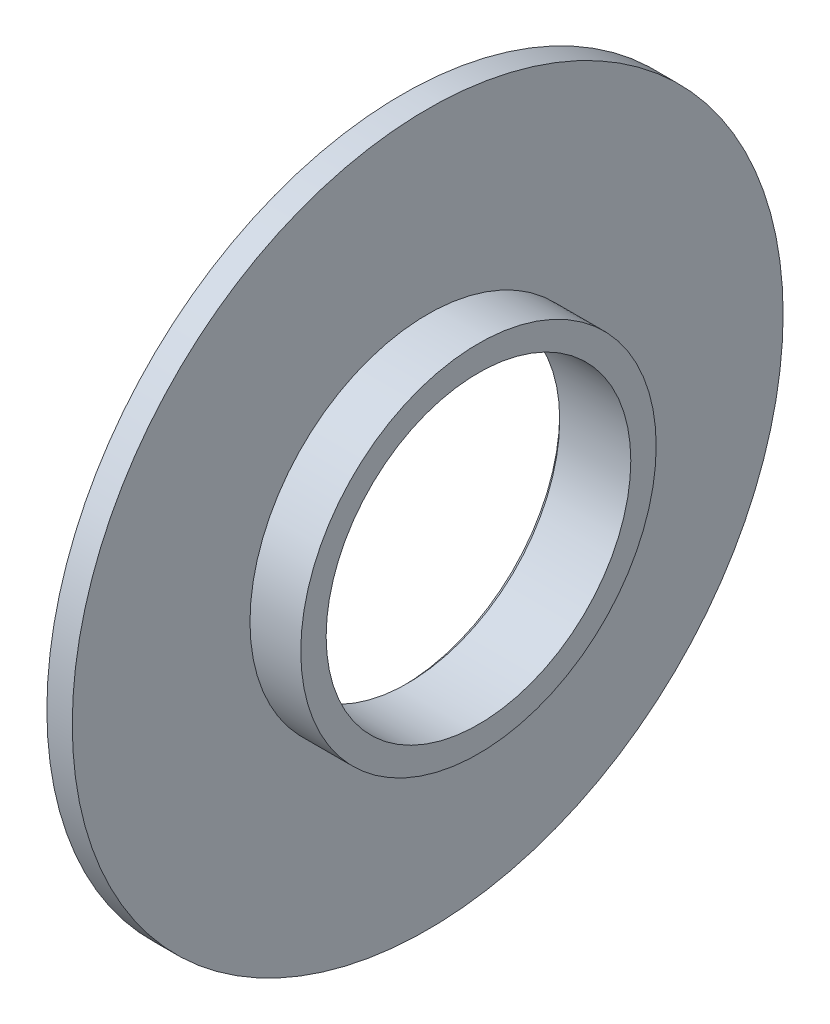
ISO-10303-21;
HEADER;
FILE_DESCRIPTION(('STEP AP214'),'2;1');
FILE_NAME('part.step','',(''),(''),'','','');
FILE_SCHEMA(('AUTOMOTIVE_DESIGN { 1 0 10303 214 1 1 1 1 }'));
ENDSEC;
DATA;
#1=APPLICATION_CONTEXT('core data for automotive mechanical design processes');
#2=APPLICATION_PROTOCOL_DEFINITION('international standard','automotive_design',2000,#1);
#3=PRODUCT_CONTEXT('',#1,'mechanical');
#4=PRODUCT('Part','Part','',(#3));
#5=PRODUCT_RELATED_PRODUCT_CATEGORY('part','',(#4));
#6=PRODUCT_DEFINITION_FORMATION('','',#4);
#7=PRODUCT_DEFINITION_CONTEXT('part definition',#1,'design');
#8=PRODUCT_DEFINITION('design','',#6,#7);
#9=PRODUCT_DEFINITION_SHAPE('','',#8);
#10=(LENGTH_UNIT() NAMED_UNIT(*) SI_UNIT(.MILLI.,.METRE.));
#11=(NAMED_UNIT(*) PLANE_ANGLE_UNIT() SI_UNIT($,.RADIAN.));
#12=(NAMED_UNIT(*) SI_UNIT($,.STERADIAN.) SOLID_ANGLE_UNIT());
#13=UNCERTAINTY_MEASURE_WITH_UNIT(LENGTH_MEASURE(1.E-05),#10,'distance_accuracy_value','');
#14=(GEOMETRIC_REPRESENTATION_CONTEXT(3) GLOBAL_UNCERTAINTY_ASSIGNED_CONTEXT((#13)) GLOBAL_UNIT_ASSIGNED_CONTEXT((#10,
#11,#12)) REPRESENTATION_CONTEXT('',''));
#15=CARTESIAN_POINT('',(0.,0.,0.));
#16=DIRECTION('',(0.,0.,1.));
#17=DIRECTION('',(1.,0.,0.));
#18=AXIS2_PLACEMENT_3D('',#15,#16,#17);
#19=CARTESIAN_POINT('',(0.,0.,0.));
#20=DIRECTION('',(-1.,0.,0.));
#21=DIRECTION('',(0.,0.,1.));
#22=AXIS2_PLACEMENT_3D('',#19,#20,#21);
#23=CYLINDRICAL_SURFACE('',#22,14.);
#24=CARTESIAN_POINT('',(0.,0.,0.));
#25=DIRECTION('',(-1.,0.,0.));
#26=DIRECTION('',(0.,0.,1.));
#27=AXIS2_PLACEMENT_3D('',#24,#25,#26);
#28=CIRCLE('',#27,14.);
#29=CARTESIAN_POINT('',(0.,0.,14.));
#30=VERTEX_POINT('',#29);
#31=EDGE_CURVE('E53',#30,#30,#28,.T.);
#32=ORIENTED_EDGE('',*,*,#31,.F.);
#33=EDGE_LOOP('',(#32));
#34=FACE_BOUND('',#33,.T.);
#35=CARTESIAN_POINT('',(1.,0.,0.));
#36=DIRECTION('',(-1.,0.,0.));
#37=DIRECTION('',(0.,0.,1.));
#38=AXIS2_PLACEMENT_3D('',#35,#36,#37);
#39=CIRCLE('',#38,14.);
#40=CARTESIAN_POINT('',(1.,0.,14.));
#41=VERTEX_POINT('',#40);
#42=EDGE_CURVE('E72',#41,#41,#39,.T.);
#43=ORIENTED_EDGE('',*,*,#42,.T.);
#44=EDGE_LOOP('',(#43));
#45=FACE_BOUND('',#44,.T.);
#46=ADVANCED_FACE('F39',(#34,#45),#23,.T.);
#47=CARTESIAN_POINT('',(0.,14.,0.));
#48=DIRECTION('',(1.,0.,0.));
#49=DIRECTION('',(0.,0.,-1.));
#50=AXIS2_PLACEMENT_3D('',#47,#48,#49);
#51=PLANE('',#50);
#52=CARTESIAN_POINT('',(0.,0.,0.));
#53=DIRECTION('',(1.,0.,0.));
#54=DIRECTION('',(0.,0.,-1.));
#55=AXIS2_PLACEMENT_3D('',#52,#53,#54);
#56=CIRCLE('',#55,6.20000000000001);
#57=CARTESIAN_POINT('',(0.,0.,-6.20000000000001));
#58=VERTEX_POINT('',#57);
#59=EDGE_CURVE('E10',#58,#58,#56,.T.);
#60=ORIENTED_EDGE('',*,*,#59,.T.);
#61=EDGE_LOOP('',(#60));
#62=FACE_BOUND('',#61,.T.);
#63=ORIENTED_EDGE('',*,*,#31,.T.);
#64=EDGE_LOOP('',(#63));
#65=FACE_BOUND('',#64,.T.);
#66=ADVANCED_FACE('F98',(#62,#65),#51,.F.);
#67=CARTESIAN_POINT('',(0.,0.,0.));
#68=DIRECTION('',(-1.,0.,0.));
#69=DIRECTION('',(0.,0.,1.));
#70=AXIS2_PLACEMENT_3D('',#67,#68,#69);
#71=CYLINDRICAL_SURFACE('',#70,6.);
#72=CARTESIAN_POINT('',(0.200000000000007,0.,0.));
#73=DIRECTION('',(1.,0.,0.));
#74=DIRECTION('',(0.,0.,-1.));
#75=AXIS2_PLACEMENT_3D('',#72,#73,#74);
#76=CIRCLE('',#75,6.);
#77=CARTESIAN_POINT('',(0.200000000000007,0.,-6.));
#78=VERTEX_POINT('',#77);
#79=EDGE_CURVE('E48',#78,#78,#76,.F.);
#80=ORIENTED_EDGE('',*,*,#79,.T.);
#81=EDGE_LOOP('',(#80));
#82=FACE_BOUND('',#81,.T.);
#83=CARTESIAN_POINT('',(3.,0.,0.));
#84=DIRECTION('',(-1.,0.,0.));
#85=DIRECTION('',(0.,0.,1.));
#86=AXIS2_PLACEMENT_3D('',#83,#84,#85);
#87=CIRCLE('',#86,6.);
#88=CARTESIAN_POINT('',(3.,0.,6.));
#89=VERTEX_POINT('',#88);
#90=EDGE_CURVE('E58',#89,#89,#87,.T.);
#91=ORIENTED_EDGE('',*,*,#90,.F.);
#92=EDGE_LOOP('',(#91));
#93=FACE_BOUND('',#92,.T.);
#94=ADVANCED_FACE('F93',(#82,#93),#71,.F.);
#95=CARTESIAN_POINT('',(3.,6.,0.));
#96=DIRECTION('',(-1.,0.,0.));
#97=DIRECTION('',(0.,0.,1.));
#98=AXIS2_PLACEMENT_3D('',#95,#96,#97);
#99=PLANE('',#98);
#100=CARTESIAN_POINT('',(3.,0.,0.));
#101=DIRECTION('',(-1.,0.,0.));
#102=DIRECTION('',(0.,0.,1.));
#103=AXIS2_PLACEMENT_3D('',#100,#101,#102);
#104=CIRCLE('',#103,7.);
#105=CARTESIAN_POINT('',(3.,0.,7.));
#106=VERTEX_POINT('',#105);
#107=EDGE_CURVE('E64',#106,#106,#104,.T.);
#108=ORIENTED_EDGE('',*,*,#107,.F.);
#109=EDGE_LOOP('',(#108));
#110=FACE_BOUND('',#109,.T.);
#111=ORIENTED_EDGE('',*,*,#90,.T.);
#112=EDGE_LOOP('',(#111));
#113=FACE_BOUND('',#112,.T.);
#114=ADVANCED_FACE('F87',(#110,#113),#99,.F.);
#115=CARTESIAN_POINT('',(0.,0.,0.));
#116=DIRECTION('',(-1.,0.,0.));
#117=DIRECTION('',(0.,0.,1.));
#118=AXIS2_PLACEMENT_3D('',#115,#116,#117);
#119=CYLINDRICAL_SURFACE('',#118,7.);
#120=CARTESIAN_POINT('',(1.,0.,0.));
#121=DIRECTION('',(-1.,0.,0.));
#122=DIRECTION('',(0.,0.,1.));
#123=AXIS2_PLACEMENT_3D('',#120,#121,#122);
#124=CIRCLE('',#123,7.);
#125=CARTESIAN_POINT('',(1.,0.,7.));
#126=VERTEX_POINT('',#125);
#127=EDGE_CURVE('E68',#126,#126,#124,.T.);
#128=ORIENTED_EDGE('',*,*,#127,.F.);
#129=EDGE_LOOP('',(#128));
#130=FACE_BOUND('',#129,.T.);
#131=ORIENTED_EDGE('',*,*,#107,.T.);
#132=EDGE_LOOP('',(#131));
#133=FACE_BOUND('',#132,.T.);
#134=ADVANCED_FACE('F81',(#130,#133),#119,.T.);
#135=CARTESIAN_POINT('',(1.,7.,0.));
#136=DIRECTION('',(-1.,0.,0.));
#137=DIRECTION('',(0.,0.,1.));
#138=AXIS2_PLACEMENT_3D('',#135,#136,#137);
#139=PLANE('',#138);
#140=ORIENTED_EDGE('',*,*,#42,.F.);
#141=EDGE_LOOP('',(#140));
#142=FACE_BOUND('',#141,.T.);
#143=ORIENTED_EDGE('',*,*,#127,.T.);
#144=EDGE_LOOP('',(#143));
#145=FACE_BOUND('',#144,.T.);
#146=ADVANCED_FACE('F78',(#142,#145),#139,.F.);
#147=CARTESIAN_POINT('',(0.200000000000007,0.,0.));
#148=DIRECTION('',(-1.,0.,0.));
#149=DIRECTION('',(0.,0.,1.));
#150=AXIS2_PLACEMENT_3D('',#147,#148,#149);
#151=CONICAL_SURFACE('',#150,6.,0.78539816339745);
#152=ORIENTED_EDGE('',*,*,#59,.F.);
#153=EDGE_LOOP('',(#152));
#154=FACE_BOUND('',#153,.T.);
#155=ORIENTED_EDGE('',*,*,#79,.F.);
#156=EDGE_LOOP('',(#155));
#157=FACE_BOUND('',#156,.T.);
#158=ADVANCED_FACE('F42',(#154,#157),#151,.F.);
#159=CLOSED_SHELL('',(#46,#66,#94,#114,#134,#146,#158));
#160=MANIFOLD_SOLID_BREP('B2',#159);
#161=ADVANCED_BREP_SHAPE_REPRESENTATION('',(#18,#160),#14);
#162=SHAPE_DEFINITION_REPRESENTATION(#9,#161);
ENDSEC;
END-ISO-10303-21;
